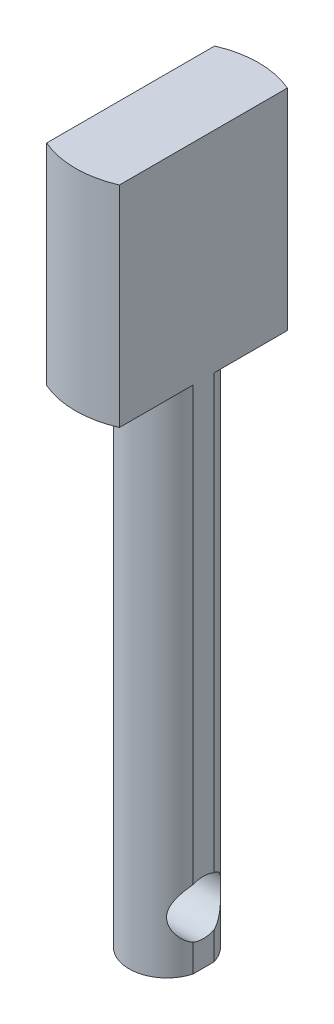
ISO-10303-21;
HEADER;
FILE_DESCRIPTION(('STEP AP214'),'2;1');
FILE_NAME('part.step','',(''),(''),'','','');
FILE_SCHEMA(('AUTOMOTIVE_DESIGN { 1 0 10303 214 1 1 1 1 }'));
ENDSEC;
DATA;
#1=APPLICATION_CONTEXT('core data for automotive mechanical design processes');
#2=APPLICATION_PROTOCOL_DEFINITION('international standard','automotive_design',2000,#1);
#3=PRODUCT_CONTEXT('',#1,'mechanical');
#4=PRODUCT('Part','Part','',(#3));
#5=PRODUCT_RELATED_PRODUCT_CATEGORY('part','',(#4));
#6=PRODUCT_DEFINITION_FORMATION('','',#4);
#7=PRODUCT_DEFINITION_CONTEXT('part definition',#1,'design');
#8=PRODUCT_DEFINITION('design','',#6,#7);
#9=PRODUCT_DEFINITION_SHAPE('','',#8);
#10=(LENGTH_UNIT() NAMED_UNIT(*) SI_UNIT(.MILLI.,.METRE.));
#11=(NAMED_UNIT(*) PLANE_ANGLE_UNIT() SI_UNIT($,.RADIAN.));
#12=(NAMED_UNIT(*) SI_UNIT($,.STERADIAN.) SOLID_ANGLE_UNIT());
#13=UNCERTAINTY_MEASURE_WITH_UNIT(LENGTH_MEASURE(1.E-05),#10,'distance_accuracy_value','');
#14=(GEOMETRIC_REPRESENTATION_CONTEXT(3) GLOBAL_UNCERTAINTY_ASSIGNED_CONTEXT((#13)) GLOBAL_UNIT_ASSIGNED_CONTEXT((#10,
#11,#12)) REPRESENTATION_CONTEXT('',''));
#15=CARTESIAN_POINT('',(0.,0.,0.));
#16=DIRECTION('',(0.,0.,1.));
#17=DIRECTION('',(1.,0.,0.));
#18=AXIS2_PLACEMENT_3D('',#15,#16,#17);
#19=CARTESIAN_POINT('',(0.,48.,0.));
#20=DIRECTION('',(0.,-1.,0.));
#21=DIRECTION('',(0.,0.,-1.));
#22=AXIS2_PLACEMENT_3D('',#19,#20,#21);
#23=CYLINDRICAL_SURFACE('',#22,2.525);
#24=DIRECTION('',(0.,-1.,0.));
#25=VECTOR('',#24,1.);
#26=CARTESIAN_POINT('',(2.425,48.,0.703562363973513));
#27=LINE('',#26,#25);
#28=CARTESIAN_POINT('',(2.425,34.,0.703562363973513));
#29=VERTEX_POINT('',#28);
#30=CARTESIAN_POINT('',(2.425,5.15680415257809,0.703562363973512));
#31=VERTEX_POINT('',#30);
#32=EDGE_CURVE('E243',#29,#31,#27,.T.);
#33=ORIENTED_EDGE('',*,*,#32,.F.);
#34=CARTESIAN_POINT('',(0.,34.,0.));
#35=DIRECTION('',(0.,1.,0.));
#36=DIRECTION('',(0.,0.,1.));
#37=AXIS2_PLACEMENT_3D('',#34,#35,#36);
#38=CIRCLE('',#37,2.525);
#39=CARTESIAN_POINT('',(-2.425,34.,0.703562363973513));
#40=VERTEX_POINT('',#39);
#41=EDGE_CURVE('E184',#40,#29,#38,.T.);
#42=ORIENTED_EDGE('',*,*,#41,.F.);
#43=DIRECTION('',(0.,-1.,0.));
#44=VECTOR('',#43,1.);
#45=CARTESIAN_POINT('',(-2.425,48.,0.703562363973513));
#46=LINE('',#45,#44);
#47=CARTESIAN_POINT('',(-2.425,5.15680415257809,0.703562363973513));
#48=VERTEX_POINT('',#47);
#49=EDGE_CURVE('E269',#40,#48,#46,.T.);
#50=ORIENTED_EDGE('',*,*,#49,.T.);
#51=CARTESIAN_POINT('',(-1.77076960669648,3.5,-1.8));
#52=CARTESIAN_POINT('',(-1.77076810094751,3.58582119509804,-1.80000105299916));
#53=CARTESIAN_POINT('',(-1.77713214567897,3.67163729450902,-1.79380537732637));
#54=CARTESIAN_POINT('',(-1.80118066545932,3.84004896386686,-1.76964482188798));
#55=CARTESIAN_POINT('',(-1.81889265799138,3.92263618623425,-1.75165133127623));
#56=CARTESIAN_POINT('',(-1.86223691373414,4.08146293092098,-1.70548412020205));
#57=CARTESIAN_POINT('',(-1.88777455669717,4.15776516589644,-1.67743137180592));
#58=CARTESIAN_POINT('',(-1.9437228570192,4.30438134902186,-1.61226885293606));
#59=CARTESIAN_POINT('',(-1.97413338685659,4.37469545380521,-1.57515931946171));
#60=CARTESIAN_POINT('',(-2.04304704212281,4.52144788379939,-1.48504498870939));
#61=CARTESIAN_POINT('',(-2.08201172713864,4.59664596104234,-1.43037338889166));
#62=CARTESIAN_POINT('',(-2.15976714792423,4.7379178100862,-1.31003023266281));
#63=CARTESIAN_POINT('',(-2.19855758555487,4.80397938543153,-1.24434422671248));
#64=CARTESIAN_POINT('',(-2.27956429083189,4.93666798907579,-1.08999108206219));
#65=CARTESIAN_POINT('',(-2.32118570846968,5.00135659335434,-0.999313910808975));
#66=CARTESIAN_POINT('',(-2.39553811986032,5.11392568931023,-0.804852540095074));
#67=CARTESIAN_POINT('',(-2.42828768216426,5.1618413487309,-0.701096392520193));
#68=CARTESIAN_POINT('',(-2.47351964955992,5.2271525519167,-0.513700283977236));
#69=CARTESIAN_POINT('',(-2.48910390776484,5.24932694308285,-0.432461486909279));
#70=CARTESIAN_POINT('',(-2.51227836851155,5.28214932996159,-0.266591702318422));
#71=CARTESIAN_POINT('',(-2.51987509083225,5.2928067265506,-0.181963540015475));
#72=CARTESIAN_POINT('',(-2.52641653831385,5.30198940200989,-0.011532789198812));
#73=CARTESIAN_POINT('',(-2.52534307176212,5.30048917183453,0.0742718913638009));
#74=CARTESIAN_POINT('',(-2.51460070776598,5.28539053894608,0.244266492128695));
#75=CARTESIAN_POINT('',(-2.50492950824406,5.27178889603039,0.328455973686911));
#76=CARTESIAN_POINT('',(-2.47818412910471,5.23376694186612,0.490740310238108));
#77=CARTESIAN_POINT('',(-2.46130630981629,5.20963324010355,0.568936127181559));
#78=CARTESIAN_POINT('',(-2.42143963840986,5.15172184298257,0.719975044439936));
#79=CARTESIAN_POINT('',(-2.39844954797805,5.11794219330331,0.792817056280915));
#80=CARTESIAN_POINT('',(-2.34498860965496,5.03764275173351,0.939915698019603));
#81=CARTESIAN_POINT('',(-2.3139692508562,4.99012189314509,1.01342304830117));
#82=CARTESIAN_POINT('',(-2.24827971827367,4.88591977152349,1.15184468716309));
#83=CARTESIAN_POINT('',(-2.21360583169931,4.82922916067779,1.21675008259511));
#84=CARTESIAN_POINT('',(-2.13629826698449,4.69648943697918,1.348595265077));
#85=CARTESIAN_POINT('',(-2.09337337211728,4.61879751031572,1.41371437590025));
#86=CARTESIAN_POINT('',(-2.00956918223257,4.45282929072434,1.53049390430448));
#87=CARTESIAN_POINT('',(-1.96868973291684,4.36455379787923,1.58215533830596));
#88=CARTESIAN_POINT('',(-1.90262386819381,4.19908107703926,1.66062058192026));
#89=CARTESIAN_POINT('',(-1.87597879101095,4.12388897340713,1.69040355801983));
#90=CARTESIAN_POINT('',(-1.83010763695563,3.9681626288228,1.73996426011704));
#91=CARTESIAN_POINT('',(-1.81086781417633,3.8876386141424,1.75976054521887));
#92=CARTESIAN_POINT('',(-1.78272507031039,3.72179528042807,1.78827986387082));
#93=CARTESIAN_POINT('',(-1.77394296022901,3.63643163093218,1.7968735870457));
#94=CARTESIAN_POINT('',(-1.76904874450535,3.46500923651231,1.8016969303574));
#95=CARTESIAN_POINT('',(-1.77292809567485,3.37895099934743,1.79793488740709));
#96=CARTESIAN_POINT('',(-1.79089638274755,3.22293083116575,1.7800071028799));
#97=CARTESIAN_POINT('',(-1.80329654827222,3.15255376143074,1.76755758162879));
#98=CARTESIAN_POINT('',(-1.83472858142534,3.01514410620804,1.73490914532359));
#99=CARTESIAN_POINT('',(-1.85376816217301,2.94811551469601,1.71470121442669));
#100=CARTESIAN_POINT('',(-1.9067545524895,2.78700657116524,1.65593527581358));
#101=CARTESIAN_POINT('',(-1.94347254774785,2.69535774120115,1.61322438776478));
#102=CARTESIAN_POINT('',(-2.02151193292697,2.52177883352461,1.51429829240113));
#103=CARTESIAN_POINT('',(-2.06284243001677,2.4398686668647,1.4580561059114));
#104=CARTESIAN_POINT('',(-2.14668963168259,2.2846837768648,1.33162898039665));
#105=CARTESIAN_POINT('',(-2.18921225087102,2.21164206811909,1.26116135555502));
#106=CARTESIAN_POINT('',(-2.27065156472609,2.07765963349933,1.10782889262294));
#107=CARTESIAN_POINT('',(-2.30957322070472,2.01670212182304,1.0249815356074));
#108=CARTESIAN_POINT('',(-2.37502141178252,1.91687213277238,0.861092483106575));
#109=CARTESIAN_POINT('',(-2.40253105745579,1.87606061885472,0.781630952236745));
#110=CARTESIAN_POINT('',(-2.45031565414908,1.80616585001127,0.615644544169371));
#111=CARTESIAN_POINT('',(-2.47059475084502,1.77707587322732,0.529123749524601));
#112=CARTESIAN_POINT('',(-2.50220771836957,1.73204108286788,0.350498780934619));
#113=CARTESIAN_POINT('',(-2.51348455888965,1.71618004823724,0.258362928967057));
#114=CARTESIAN_POINT('',(-2.52569307274043,1.69901713993576,0.0720743795875827));
#115=CARTESIAN_POINT('',(-2.5266300493643,1.69770780272928,-0.0220772591007935));
#116=CARTESIAN_POINT('',(-2.51853966751819,1.70907097708854,-0.198958618098572));
#117=CARTESIAN_POINT('',(-2.51056146400113,1.72027126432032,-0.281838134004694));
#118=CARTESIAN_POINT('',(-2.48697497797968,1.75370115656139,-0.444198719165162));
#119=CARTESIAN_POINT('',(-2.47136538325461,1.77593265840215,-0.523679201397424));
#120=CARTESIAN_POINT('',(-2.43323989389027,1.83103725766324,-0.679379908235538));
#121=CARTESIAN_POINT('',(-2.41056312991609,1.86415933904167,-0.755471340226878));
#122=CARTESIAN_POINT('',(-2.36002276235754,1.93959446340025,-0.901034092267312));
#123=CARTESIAN_POINT('',(-2.33215820282155,1.98190920054512,-0.970504188634431));
#124=CARTESIAN_POINT('',(-2.26832578877282,2.08176900887911,-1.11232321700067));
#125=CARTESIAN_POINT('',(-2.23177106631432,2.14065691986702,-1.18346023970153));
#126=CARTESIAN_POINT('',(-2.15657633518581,2.2679934475645,-1.31552097981812));
#127=CARTESIAN_POINT('',(-2.11793249276589,2.33646003462878,-1.37642501538807));
#128=CARTESIAN_POINT('',(-2.03497734893443,2.49460377098358,-1.49689464514385));
#129=CARTESIAN_POINT('',(-1.99082514901794,2.58590640235425,-1.55445560581704));
#130=CARTESIAN_POINT('',(-1.90959103296449,2.77985170309116,-1.65323103786958));
#131=CARTESIAN_POINT('',(-1.87249562630936,2.88247213027492,-1.69447686537487));
#132=CARTESIAN_POINT('',(-1.82034031431036,3.07100466553634,-1.75016602394118));
#133=CARTESIAN_POINT('',(-1.80210159625901,3.15479028846788,-1.76871181600828));
#134=CARTESIAN_POINT('',(-1.77733448858409,3.32572625661336,-1.79361006468503));
#135=CARTESIAN_POINT('',(-1.77077113548316,3.41286575470979,-1.79999893089013));
#136=CARTESIAN_POINT('',(-1.77076960669648,3.5,-1.8));
#137=B_SPLINE_CURVE_WITH_KNOTS('',3,(#51,#52,#53,#54,#55,#56,#57,#58,#59,#60,#61,#62,#63,#64,
#65,#66,#67,#68,#69,#70,#71,#72,#73,#74,#75,#76,#77,#78,#79,#80,#81,#82,#83,#84,#85,#86,#87,#88,
#89,#90,#91,#92,#93,#94,#95,#96,#97,#98,#99,#100,#101,#102,#103,#104,#105,#106,#107,#108,#109,
#110,#111,#112,#113,#114,#115,#116,#117,#118,#119,#120,#121,#122,#123,#124,#125,#126,#127,#128,
#129,#130,#131,#132,#133,#134,#135,#136),.UNSPECIFIED.,.T.,.F.,(4,2,2,2,2,2,2,2,2,2,2,2,2,2,2,2,
2,2,2,2,2,2,2,2,2,2,2,2,2,2,2,2,2,2,2,2,2,2,2,2,2,2,4),(0.,0.25704924490154,0.514724176323155,
0.769398890032358,1.02406694008813,1.3254200712881,1.62717167864264,1.98192000050822,
2.33592000452865,2.59174612852425,2.84736327346881,3.10351689112599,3.35973911560626,
3.60938563993282,3.85908277991651,4.13664504047952,4.41449205730821,4.7434319805768,
5.0723470527295,5.32692671208157,5.58103150563166,5.83804417438134,6.09488346238825,
6.31161832572465,6.52860581700345,6.84958989340351,7.17121934158804,7.50001356396484,
7.82834781747174,8.10761823860788,8.38672828001318,8.66759278634654,8.94831323120067,
9.19917775093287,9.45008542209675,9.70718261971758,9.96432723944085,10.2611788492834,
10.5585950367273,10.9068004553711,11.2543333665568,11.5161006487374,11.7770827048755),.UNSPECIFIED.);
#138=CARTESIAN_POINT('',(-2.425,1.84319584742191,0.703562363973513));
#139=VERTEX_POINT('',#138);
#140=EDGE_CURVE('E297',#48,#139,#137,.T.);
#141=ORIENTED_EDGE('',*,*,#140,.T.);
#142=CARTESIAN_POINT('',(-2.425,0.,0.703562363973513));
#143=VERTEX_POINT('',#142);
#144=EDGE_CURVE('E84',#139,#143,#46,.T.);
#145=ORIENTED_EDGE('',*,*,#144,.T.);
#146=CARTESIAN_POINT('',(0.,0.,0.));
#147=DIRECTION('',(0.,1.,0.));
#148=DIRECTION('',(0.,0.,1.));
#149=AXIS2_PLACEMENT_3D('',#146,#147,#148);
#150=CIRCLE('',#149,2.525);
#151=CARTESIAN_POINT('',(2.425,0.,0.703562363973513));
#152=VERTEX_POINT('',#151);
#153=EDGE_CURVE('E174',#143,#152,#150,.T.);
#154=ORIENTED_EDGE('',*,*,#153,.T.);
#155=CARTESIAN_POINT('',(2.425,1.84319584742191,0.703562363973512));
#156=VERTEX_POINT('',#155);
#157=EDGE_CURVE('E204',#156,#152,#27,.T.);
#158=ORIENTED_EDGE('',*,*,#157,.F.);
#159=CARTESIAN_POINT('',(1.77076960669648,3.5,-1.8));
#160=CARTESIAN_POINT('',(1.77076810094751,3.41417880490196,-1.80000105299916));
#161=CARTESIAN_POINT('',(1.77713214567897,3.32836270549098,-1.79380537732637));
#162=CARTESIAN_POINT('',(1.80118066545932,3.15995103613314,-1.76964482188798));
#163=CARTESIAN_POINT('',(1.81889265799138,3.07736381376575,-1.75165133127623));
#164=CARTESIAN_POINT('',(1.86223691373414,2.91853706907902,-1.70548412020205));
#165=CARTESIAN_POINT('',(1.88777455669717,2.84223483410356,-1.67743137180592));
#166=CARTESIAN_POINT('',(1.9437228570192,2.69561865097814,-1.61226885293606));
#167=CARTESIAN_POINT('',(1.97413338685659,2.62530454619479,-1.57515931946171));
#168=CARTESIAN_POINT('',(2.04304704212281,2.47855211620061,-1.48504498870939));
#169=CARTESIAN_POINT('',(2.08201172713864,2.40335403895766,-1.43037338889166));
#170=CARTESIAN_POINT('',(2.15976714792423,2.2620821899138,-1.31003023266281));
#171=CARTESIAN_POINT('',(2.19855758555487,2.19602061456847,-1.24434422671248));
#172=CARTESIAN_POINT('',(2.27956429083189,2.06333201092421,-1.08999108206219));
#173=CARTESIAN_POINT('',(2.32118570846968,1.99864340664566,-0.999313910808975));
#174=CARTESIAN_POINT('',(2.39553811986032,1.88607431068977,-0.804852540095075));
#175=CARTESIAN_POINT('',(2.42828768216426,1.8381586512691,-0.701096392520195));
#176=CARTESIAN_POINT('',(2.47351964955992,1.7728474480833,-0.513700283977237));
#177=CARTESIAN_POINT('',(2.48910390776484,1.75067305691715,-0.43246148690928));
#178=CARTESIAN_POINT('',(2.51227836851155,1.71785067003841,-0.266591702318423));
#179=CARTESIAN_POINT('',(2.51987509083225,1.7071932734494,-0.181963540015477));
#180=CARTESIAN_POINT('',(2.52641653831384,1.69801059799011,-0.0115327891988133));
#181=CARTESIAN_POINT('',(2.52534307176212,1.69951082816547,0.0742718913637996));
#182=CARTESIAN_POINT('',(2.51460070776598,1.71460946105392,0.244266492128693));
#183=CARTESIAN_POINT('',(2.50492950824406,1.72821110396961,0.32845597368691));
#184=CARTESIAN_POINT('',(2.47818412910471,1.76623305813388,0.490740310238106));
#185=CARTESIAN_POINT('',(2.46130630981629,1.79036675989645,0.568936127181558));
#186=CARTESIAN_POINT('',(2.42143963840986,1.84827815701743,0.719975044439935));
#187=CARTESIAN_POINT('',(2.39844954797805,1.88205780669668,0.792817056280914));
#188=CARTESIAN_POINT('',(2.34498860965496,1.96235724826649,0.939915698019601));
#189=CARTESIAN_POINT('',(2.3139692508562,2.00987810685491,1.01342304830116));
#190=CARTESIAN_POINT('',(2.24827971827367,2.11408022847651,1.15184468716309));
#191=CARTESIAN_POINT('',(2.21360583169931,2.17077083932221,1.21675008259511));
#192=CARTESIAN_POINT('',(2.13629826698449,2.30351056302081,1.348595265077));
#193=CARTESIAN_POINT('',(2.09337337211728,2.38120248968428,1.41371437590025));
#194=CARTESIAN_POINT('',(2.00956918223257,2.54717070927566,1.53049390430447));
#195=CARTESIAN_POINT('',(1.96868973291684,2.63544620212077,1.58215533830596));
#196=CARTESIAN_POINT('',(1.90262386819381,2.80091892296074,1.66062058192026));
#197=CARTESIAN_POINT('',(1.87597879101095,2.87611102659287,1.69040355801983));
#198=CARTESIAN_POINT('',(1.83010763695563,3.0318373711772,1.73996426011704));
#199=CARTESIAN_POINT('',(1.81086781417633,3.1123613858576,1.75976054521887));
#200=CARTESIAN_POINT('',(1.78272507031039,3.27820471957192,1.78827986387082));
#201=CARTESIAN_POINT('',(1.77394296022901,3.36356836906782,1.7968735870457));
#202=CARTESIAN_POINT('',(1.76904874450535,3.53499076348769,1.8016969303574));
#203=CARTESIAN_POINT('',(1.77292809567485,3.62104900065257,1.79793488740709));
#204=CARTESIAN_POINT('',(1.79089638274755,3.77706916883425,1.7800071028799));
#205=CARTESIAN_POINT('',(1.80329654827222,3.84744623856926,1.76755758162879));
#206=CARTESIAN_POINT('',(1.83472858142534,3.98485589379196,1.7349091453236));
#207=CARTESIAN_POINT('',(1.853768162173,4.05188448530399,1.7147012144267));
#208=CARTESIAN_POINT('',(1.9067545524895,4.21299342883476,1.65593527581358));
#209=CARTESIAN_POINT('',(1.94347254774785,4.30464225879885,1.61322438776478));
#210=CARTESIAN_POINT('',(2.02151193292697,4.47822116647539,1.51429829240114));
#211=CARTESIAN_POINT('',(2.06284243001677,4.5601313331353,1.4580561059114));
#212=CARTESIAN_POINT('',(2.14668963168259,4.7153162231352,1.33162898039665));
#213=CARTESIAN_POINT('',(2.18921225087102,4.78835793188091,1.26116135555502));
#214=CARTESIAN_POINT('',(2.27065156472609,4.92234036650067,1.10782889262295));
#215=CARTESIAN_POINT('',(2.30957322070472,4.98329787817696,1.0249815356074));
#216=CARTESIAN_POINT('',(2.37502141178252,5.08312786722762,0.861092483106577));
#217=CARTESIAN_POINT('',(2.40253105745579,5.12393938114528,0.781630952236747));
#218=CARTESIAN_POINT('',(2.45031565414908,5.19383414998873,0.615644544169373));
#219=CARTESIAN_POINT('',(2.47059475084502,5.22292412677268,0.529123749524603));
#220=CARTESIAN_POINT('',(2.50220771836957,5.26795891713212,0.350498780934621));
#221=CARTESIAN_POINT('',(2.51348455888965,5.28381995176276,0.258362928967059));
#222=CARTESIAN_POINT('',(2.52569307274043,5.30098286006424,0.0720743795875845));
#223=CARTESIAN_POINT('',(2.5266300493643,5.30229219727072,-0.0220772591007918));
#224=CARTESIAN_POINT('',(2.51853966751819,5.29092902291146,-0.19895861809857));
#225=CARTESIAN_POINT('',(2.51056146400113,5.27972873567968,-0.281838134004692));
#226=CARTESIAN_POINT('',(2.48697497797968,5.24629884343861,-0.44419871916516));
#227=CARTESIAN_POINT('',(2.47136538325461,5.22406734159785,-0.523679201397422));
#228=CARTESIAN_POINT('',(2.43323989389027,5.16896274233676,-0.679379908235536));
#229=CARTESIAN_POINT('',(2.41056312991609,5.13584066095833,-0.755471340226877));
#230=CARTESIAN_POINT('',(2.36002276235754,5.06040553659975,-0.901034092267311));
#231=CARTESIAN_POINT('',(2.33215820282155,5.01809079945488,-0.97050418863443));
#232=CARTESIAN_POINT('',(2.26832578877282,4.91823099112089,-1.11232321700067));
#233=CARTESIAN_POINT('',(2.23177106631432,4.85934308013298,-1.18346023970153));
#234=CARTESIAN_POINT('',(2.15657633518581,4.7320065524355,-1.31552097981812));
#235=CARTESIAN_POINT('',(2.11793249276589,4.66353996537122,-1.37642501538807));
#236=CARTESIAN_POINT('',(2.03497734893443,4.50539622901643,-1.49689464514385));
#237=CARTESIAN_POINT('',(1.99082514901794,4.41409359764575,-1.55445560581704));
#238=CARTESIAN_POINT('',(1.90959103296449,4.22014829690884,-1.65323103786958));
#239=CARTESIAN_POINT('',(1.87249562630936,4.11752786972508,-1.69447686537487));
#240=CARTESIAN_POINT('',(1.82034031431036,3.92899533446366,-1.75016602394118));
#241=CARTESIAN_POINT('',(1.80210159625901,3.84520971153212,-1.76871181600828));
#242=CARTESIAN_POINT('',(1.77733448858409,3.67427374338664,-1.79361006468503));
#243=CARTESIAN_POINT('',(1.77077113548316,3.58713424529021,-1.79999893089013));
#244=CARTESIAN_POINT('',(1.77076960669648,3.5,-1.8));
#245=B_SPLINE_CURVE_WITH_KNOTS('',3,(#159,#160,#161,#162,#163,#164,#165,#166,#167,#168,#169,
#170,#171,#172,#173,#174,#175,#176,#177,#178,#179,#180,#181,#182,#183,#184,#185,#186,#187,#188,
#189,#190,#191,#192,#193,#194,#195,#196,#197,#198,#199,#200,#201,#202,#203,#204,#205,#206,#207,
#208,#209,#210,#211,#212,#213,#214,#215,#216,#217,#218,#219,#220,#221,#222,#223,#224,#225,#226,
#227,#228,#229,#230,#231,#232,#233,#234,#235,#236,#237,#238,#239,#240,#241,#242,#243,#244),
.UNSPECIFIED.,.T.,.F.,(4,2,2,2,2,2,2,2,2,2,2,2,2,2,2,2,2,2,2,2,2,2,2,2,2,2,2,2,2,2,2,2,2,2,2,2,
2,2,2,2,2,2,4),(0.,0.25704924490154,0.514724176323155,0.769398890032359,1.02406694008813,
1.3254200712881,1.62717167864264,1.98192000050822,2.33592000452864,2.59174612852425,
2.84736327346881,3.10351689112599,3.35973911560626,3.60938563993282,3.85908277991651,
4.13664504047952,4.41449205730821,4.7434319805768,5.0723470527295,5.32692671208157,
5.58103150563166,5.83804417438134,6.09488346238825,6.31161832572465,6.52860581700345,
6.8495898934035,7.17121934158804,7.50001356396483,7.82834781747173,8.10761823860787,
8.38672828001318,8.66759278634654,8.94831323120067,9.19917775093286,9.45008542209675,
9.70718261971758,9.96432723944084,10.2611788492834,10.5585950367273,10.9068004553711,
11.2543333665568,11.5161006487374,11.7770827048755),.UNSPECIFIED.);
#246=EDGE_CURVE('E203',#156,#31,#245,.T.);
#247=ORIENTED_EDGE('',*,*,#246,.T.);
#248=EDGE_LOOP('',(#33,#42,#50,#141,#145,#154,#158,#247));
#249=FACE_BOUND('',#248,.T.);
#250=ADVANCED_FACE('F68',(#249),#23,.T.);
#251=DIRECTION('',(0.,-1.,0.));
#252=VECTOR('',#251,1.);
#253=CARTESIAN_POINT('',(2.425,48.,-0.703562363973513));
#254=LINE('',#253,#252);
#255=CARTESIAN_POINT('',(2.425,0.,-0.703562363973513));
#256=VERTEX_POINT('',#255);
#257=CARTESIAN_POINT('',(2.42500000000026,1.84319584742153,-0.703562363973805));
#258=VERTEX_POINT('',#257);
#259=EDGE_CURVE('E182',#256,#258,#254,.F.);
#260=ORIENTED_EDGE('',*,*,#259,.F.);
#261=CARTESIAN_POINT('',(-2.425,0.,-0.703562363973513));
#262=VERTEX_POINT('',#261);
#263=EDGE_CURVE('E172',#256,#262,#150,.T.);
#264=ORIENTED_EDGE('',*,*,#263,.T.);
#265=DIRECTION('',(0.,-1.,0.));
#266=VECTOR('',#265,1.);
#267=CARTESIAN_POINT('',(-2.425,48.,-0.703562363973513));
#268=LINE('',#267,#266);
#269=CARTESIAN_POINT('',(-2.425,1.84319584742191,-0.703562363973513));
#270=VERTEX_POINT('',#269);
#271=EDGE_CURVE('E155',#262,#270,#268,.F.);
#272=ORIENTED_EDGE('',*,*,#271,.T.);
#273=CARTESIAN_POINT('',(-2.42500000000026,5.15680415257847,-0.703562363973806));
#274=VERTEX_POINT('',#273);
#275=EDGE_CURVE('E205',#270,#274,#137,.T.);
#276=ORIENTED_EDGE('',*,*,#275,.T.);
#277=CARTESIAN_POINT('',(-2.425,34.,-0.703562363973513));
#278=VERTEX_POINT('',#277);
#279=EDGE_CURVE('E92',#274,#278,#268,.F.);
#280=ORIENTED_EDGE('',*,*,#279,.T.);
#281=CARTESIAN_POINT('',(2.425,34.,-0.703562363973513));
#282=VERTEX_POINT('',#281);
#283=EDGE_CURVE('E189',#282,#278,#38,.T.);
#284=ORIENTED_EDGE('',*,*,#283,.F.);
#285=CARTESIAN_POINT('',(2.425,5.15680415257809,-0.703562363973512));
#286=VERTEX_POINT('',#285);
#287=EDGE_CURVE('E251',#286,#282,#254,.F.);
#288=ORIENTED_EDGE('',*,*,#287,.F.);
#289=EDGE_CURVE('E196',#286,#258,#245,.T.);
#290=ORIENTED_EDGE('',*,*,#289,.T.);
#291=EDGE_LOOP('',(#260,#264,#272,#276,#280,#284,#288,#290));
#292=FACE_BOUND('',#291,.T.);
#293=ADVANCED_FACE('F180',(#292),#23,.T.);
#294=CARTESIAN_POINT('',(0.,0.,0.));
#295=DIRECTION('',(0.,1.,0.));
#296=DIRECTION('',(0.,0.,1.));
#297=AXIS2_PLACEMENT_3D('',#294,#295,#296);
#298=PLANE('',#297);
#299=DIRECTION('',(0.,0.,1.));
#300=VECTOR('',#299,1.);
#301=CARTESIAN_POINT('',(2.425,0.,0.));
#302=LINE('',#301,#300);
#303=EDGE_CURVE('E177',#256,#152,#302,.T.);
#304=ORIENTED_EDGE('',*,*,#303,.T.);
#305=ORIENTED_EDGE('',*,*,#153,.F.);
#306=DIRECTION('',(0.,0.,1.));
#307=VECTOR('',#306,1.);
#308=CARTESIAN_POINT('',(-2.425,0.,0.));
#309=LINE('',#308,#307);
#310=EDGE_CURVE('E158',#262,#143,#309,.T.);
#311=ORIENTED_EDGE('',*,*,#310,.F.);
#312=ORIENTED_EDGE('',*,*,#263,.F.);
#313=EDGE_LOOP('',(#304,#305,#311,#312));
#314=FACE_BOUND('',#313,.T.);
#315=ADVANCED_FACE('F171',(#314),#298,.F.);
#316=CARTESIAN_POINT('',(0.,34.,0.));
#317=DIRECTION('',(0.,1.,0.));
#318=DIRECTION('',(0.,0.,1.));
#319=AXIS2_PLACEMENT_3D('',#316,#317,#318);
#320=CYLINDRICAL_SURFACE('',#319,6.1);
#321=CARTESIAN_POINT('',(0.,48.,0.));
#322=DIRECTION('',(0.,1.,0.));
#323=DIRECTION('',(0.,0.,1.));
#324=AXIS2_PLACEMENT_3D('',#321,#322,#323);
#325=CIRCLE('',#324,6.1);
#326=CARTESIAN_POINT('',(2.425,48.,-5.59726495710182));
#327=VERTEX_POINT('',#326);
#328=CARTESIAN_POINT('',(-2.425,48.,-5.59726495710182));
#329=VERTEX_POINT('',#328);
#330=EDGE_CURVE('E286',#327,#329,#325,.T.);
#331=ORIENTED_EDGE('',*,*,#330,.F.);
#332=DIRECTION('',(0.,1.,0.));
#333=VECTOR('',#332,1.);
#334=CARTESIAN_POINT('',(2.425,34.,-5.59726495710182));
#335=LINE('',#334,#333);
#336=CARTESIAN_POINT('',(2.425,34.,-5.59726495710182));
#337=VERTEX_POINT('',#336);
#338=EDGE_CURVE('E282',#327,#337,#335,.F.);
#339=ORIENTED_EDGE('',*,*,#338,.T.);
#340=CARTESIAN_POINT('',(0.,34.,0.));
#341=DIRECTION('',(0.,1.,0.));
#342=DIRECTION('',(0.,0.,1.));
#343=AXIS2_PLACEMENT_3D('',#340,#341,#342);
#344=CIRCLE('',#343,6.1);
#345=CARTESIAN_POINT('',(-2.425,34.,-5.59726495710182));
#346=VERTEX_POINT('',#345);
#347=EDGE_CURVE('E191',#337,#346,#344,.T.);
#348=ORIENTED_EDGE('',*,*,#347,.T.);
#349=DIRECTION('',(0.,1.,0.));
#350=VECTOR('',#349,1.);
#351=CARTESIAN_POINT('',(-2.425,34.,-5.59726495710182));
#352=LINE('',#351,#350);
#353=EDGE_CURVE('E165',#329,#346,#352,.F.);
#354=ORIENTED_EDGE('',*,*,#353,.F.);
#355=EDGE_LOOP('',(#331,#339,#348,#354));
#356=FACE_BOUND('',#355,.T.);
#357=ADVANCED_FACE('F226',(#356),#320,.T.);
#358=CARTESIAN_POINT('',(-2.425,34.,5.59726495710182));
#359=VERTEX_POINT('',#358);
#360=CARTESIAN_POINT('',(2.425,34.,5.59726495710182));
#361=VERTEX_POINT('',#360);
#362=EDGE_CURVE('E259',#359,#361,#344,.T.);
#363=ORIENTED_EDGE('',*,*,#362,.T.);
#364=DIRECTION('',(0.,1.,0.));
#365=VECTOR('',#364,1.);
#366=CARTESIAN_POINT('',(2.425,34.,5.59726495710182));
#367=LINE('',#366,#365);
#368=CARTESIAN_POINT('',(2.425,48.,5.59726495710182));
#369=VERTEX_POINT('',#368);
#370=EDGE_CURVE('E278',#361,#369,#367,.T.);
#371=ORIENTED_EDGE('',*,*,#370,.T.);
#372=CARTESIAN_POINT('',(-2.425,48.,5.59726495710182));
#373=VERTEX_POINT('',#372);
#374=EDGE_CURVE('E193',#373,#369,#325,.T.);
#375=ORIENTED_EDGE('',*,*,#374,.F.);
#376=DIRECTION('',(0.,1.,0.));
#377=VECTOR('',#376,1.);
#378=CARTESIAN_POINT('',(-2.425,34.,5.59726495710182));
#379=LINE('',#378,#377);
#380=EDGE_CURVE('E262',#359,#373,#379,.T.);
#381=ORIENTED_EDGE('',*,*,#380,.F.);
#382=EDGE_LOOP('',(#363,#371,#375,#381));
#383=FACE_BOUND('',#382,.T.);
#384=ADVANCED_FACE('F224',(#383),#320,.T.);
#385=CARTESIAN_POINT('',(0.,34.,0.));
#386=DIRECTION('',(0.,1.,0.));
#387=DIRECTION('',(0.,0.,1.));
#388=AXIS2_PLACEMENT_3D('',#385,#386,#387);
#389=PLANE('',#388);
#390=DIRECTION('',(0.,0.,-1.));
#391=VECTOR('',#390,1.);
#392=CARTESIAN_POINT('',(2.425,34.,0.));
#393=LINE('',#392,#391);
#394=EDGE_CURVE('E256',#361,#29,#393,.T.);
#395=ORIENTED_EDGE('',*,*,#394,.F.);
#396=ORIENTED_EDGE('',*,*,#362,.F.);
#397=DIRECTION('',(0.,0.,-1.));
#398=VECTOR('',#397,1.);
#399=CARTESIAN_POINT('',(-2.425,34.,0.));
#400=LINE('',#399,#398);
#401=EDGE_CURVE('E258',#359,#40,#400,.T.);
#402=ORIENTED_EDGE('',*,*,#401,.T.);
#403=ORIENTED_EDGE('',*,*,#41,.T.);
#404=EDGE_LOOP('',(#395,#396,#402,#403));
#405=FACE_BOUND('',#404,.T.);
#406=ADVANCED_FACE('F219',(#405),#389,.F.);
#407=EDGE_CURVE('E250',#282,#337,#393,.T.);
#408=ORIENTED_EDGE('',*,*,#407,.F.);
#409=ORIENTED_EDGE('',*,*,#283,.T.);
#410=EDGE_CURVE('E263',#278,#346,#400,.T.);
#411=ORIENTED_EDGE('',*,*,#410,.T.);
#412=ORIENTED_EDGE('',*,*,#347,.F.);
#413=EDGE_LOOP('',(#408,#409,#411,#412));
#414=FACE_BOUND('',#413,.T.);
#415=ADVANCED_FACE('F223',(#414),#389,.F.);
#416=CARTESIAN_POINT('',(0.,48.,0.));
#417=DIRECTION('',(0.,1.,0.));
#418=DIRECTION('',(0.,0.,1.));
#419=AXIS2_PLACEMENT_3D('',#416,#417,#418);
#420=PLANE('',#419);
#421=ORIENTED_EDGE('',*,*,#374,.T.);
#422=DIRECTION('',(0.,0.,1.));
#423=VECTOR('',#422,1.);
#424=CARTESIAN_POINT('',(2.425,48.,0.));
#425=LINE('',#424,#423);
#426=EDGE_CURVE('E176',#327,#369,#425,.T.);
#427=ORIENTED_EDGE('',*,*,#426,.F.);
#428=ORIENTED_EDGE('',*,*,#330,.T.);
#429=DIRECTION('',(0.,0.,1.));
#430=VECTOR('',#429,1.);
#431=CARTESIAN_POINT('',(-2.425,48.,0.));
#432=LINE('',#431,#430);
#433=EDGE_CURVE('E310',#329,#373,#432,.T.);
#434=ORIENTED_EDGE('',*,*,#433,.T.);
#435=EDGE_LOOP('',(#421,#427,#428,#434));
#436=FACE_BOUND('',#435,.T.);
#437=ADVANCED_FACE('F215',(#436),#420,.T.);
#438=CARTESIAN_POINT('',(-6.1,3.5,0.));
#439=DIRECTION('',(1.,0.,0.));
#440=DIRECTION('',(0.,0.,-1.));
#441=AXIS2_PLACEMENT_3D('',#438,#439,#440);
#442=CYLINDRICAL_SURFACE('',#441,1.8);
#443=ORIENTED_EDGE('',*,*,#275,.F.);
#444=CARTESIAN_POINT('',(-2.425,3.5,0.));
#445=DIRECTION('',(1.,0.,0.));
#446=DIRECTION('',(0.,0.,-1.));
#447=AXIS2_PLACEMENT_3D('',#444,#445,#446);
#448=CIRCLE('',#447,1.8);
#449=EDGE_CURVE('E159',#270,#139,#448,.F.);
#450=ORIENTED_EDGE('',*,*,#449,.T.);
#451=ORIENTED_EDGE('',*,*,#140,.F.);
#452=EDGE_CURVE('E325',#48,#274,#448,.F.);
#453=ORIENTED_EDGE('',*,*,#452,.T.);
#454=EDGE_LOOP('',(#443,#450,#451,#453));
#455=FACE_BOUND('',#454,.T.);
#456=CARTESIAN_POINT('',(2.425,3.5,0.));
#457=DIRECTION('',(1.,0.,0.));
#458=DIRECTION('',(0.,0.,-1.));
#459=AXIS2_PLACEMENT_3D('',#456,#457,#458);
#460=CIRCLE('',#459,1.8);
#461=EDGE_CURVE('E13',#258,#156,#460,.F.);
#462=ORIENTED_EDGE('',*,*,#461,.F.);
#463=ORIENTED_EDGE('',*,*,#289,.F.);
#464=EDGE_CURVE('E72',#31,#286,#460,.F.);
#465=ORIENTED_EDGE('',*,*,#464,.F.);
#466=ORIENTED_EDGE('',*,*,#246,.F.);
#467=EDGE_LOOP('',(#462,#463,#465,#466));
#468=FACE_BOUND('',#467,.T.);
#469=ADVANCED_FACE('F209',(#455,#468),#442,.F.);
#470=CARTESIAN_POINT('',(-2.425,48.,0.));
#471=DIRECTION('',(1.,0.,0.));
#472=DIRECTION('',(0.,0.,-1.));
#473=AXIS2_PLACEMENT_3D('',#470,#471,#472);
#474=PLANE('',#473);
#475=ORIENTED_EDGE('',*,*,#353,.T.);
#476=ORIENTED_EDGE('',*,*,#410,.F.);
#477=ORIENTED_EDGE('',*,*,#279,.F.);
#478=ORIENTED_EDGE('',*,*,#452,.F.);
#479=ORIENTED_EDGE('',*,*,#49,.F.);
#480=ORIENTED_EDGE('',*,*,#401,.F.);
#481=ORIENTED_EDGE('',*,*,#380,.T.);
#482=ORIENTED_EDGE('',*,*,#433,.F.);
#483=EDGE_LOOP('',(#475,#476,#477,#478,#479,#480,#481,#482));
#484=FACE_BOUND('',#483,.T.);
#485=ADVANCED_FACE('F214',(#484),#474,.F.);
#486=ORIENTED_EDGE('',*,*,#449,.F.);
#487=ORIENTED_EDGE('',*,*,#271,.F.);
#488=ORIENTED_EDGE('',*,*,#310,.T.);
#489=ORIENTED_EDGE('',*,*,#144,.F.);
#490=EDGE_LOOP('',(#486,#487,#488,#489));
#491=FACE_BOUND('',#490,.T.);
#492=ADVANCED_FACE('F157',(#491),#474,.F.);
#493=CARTESIAN_POINT('',(2.425,48.,0.));
#494=DIRECTION('',(1.,0.,0.));
#495=DIRECTION('',(0.,0.,-1.));
#496=AXIS2_PLACEMENT_3D('',#493,#494,#495);
#497=PLANE('',#496);
#498=ORIENTED_EDGE('',*,*,#426,.T.);
#499=ORIENTED_EDGE('',*,*,#370,.F.);
#500=ORIENTED_EDGE('',*,*,#394,.T.);
#501=ORIENTED_EDGE('',*,*,#32,.T.);
#502=ORIENTED_EDGE('',*,*,#464,.T.);
#503=ORIENTED_EDGE('',*,*,#287,.T.);
#504=ORIENTED_EDGE('',*,*,#407,.T.);
#505=ORIENTED_EDGE('',*,*,#338,.F.);
#506=EDGE_LOOP('',(#498,#499,#500,#501,#502,#503,#504,#505));
#507=FACE_BOUND('',#506,.T.);
#508=ADVANCED_FACE('F217',(#507),#497,.T.);
#509=ORIENTED_EDGE('',*,*,#157,.T.);
#510=ORIENTED_EDGE('',*,*,#303,.F.);
#511=ORIENTED_EDGE('',*,*,#259,.T.);
#512=ORIENTED_EDGE('',*,*,#461,.T.);
#513=EDGE_LOOP('',(#509,#510,#511,#512));
#514=FACE_BOUND('',#513,.T.);
#515=ADVANCED_FACE('F333',(#514),#497,.T.);
#516=CLOSED_SHELL('',(#250,#293,#315,#357,#384,#406,#415,#437,#469,#485,#492,#508,#515));
#517=MANIFOLD_SOLID_BREP('B2',#516);
#518=ADVANCED_BREP_SHAPE_REPRESENTATION('',(#18,#517),#14);
#519=SHAPE_DEFINITION_REPRESENTATION(#9,#518);
ENDSEC;
END-ISO-10303-21;
